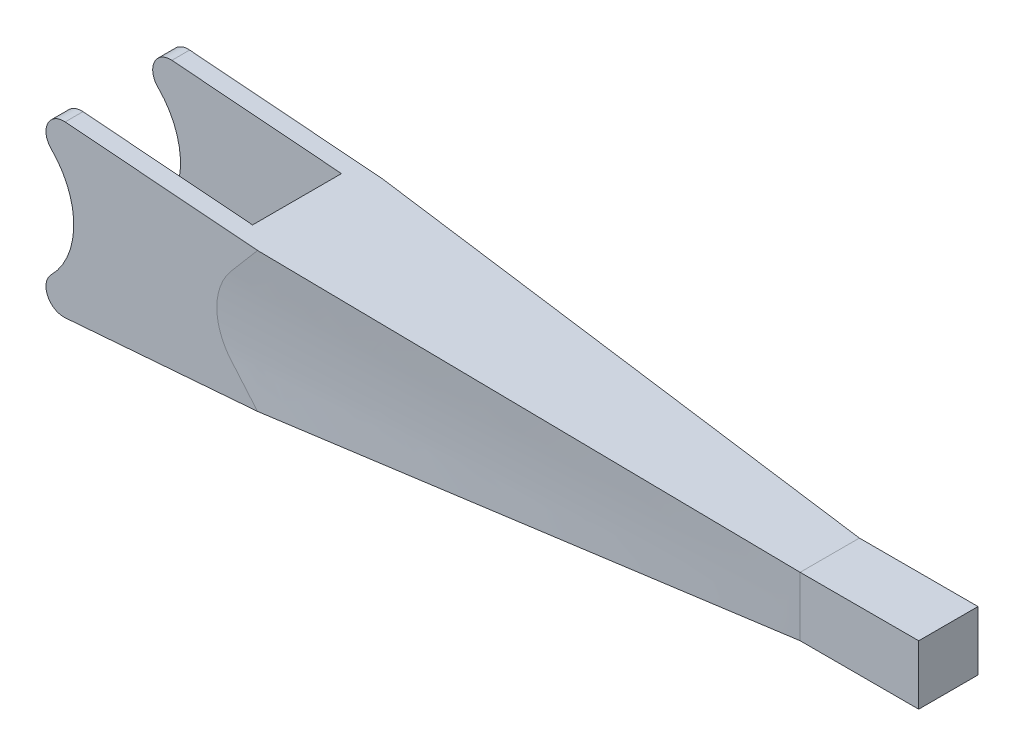
ISO-10303-21;
HEADER;
FILE_DESCRIPTION(('STEP AP214'),'2;1');
FILE_NAME('part.step','',(''),(''),'','','');
FILE_SCHEMA(('AUTOMOTIVE_DESIGN { 1 0 10303 214 1 1 1 1 }'));
ENDSEC;
DATA;
#1=APPLICATION_CONTEXT('core data for automotive mechanical design processes');
#2=APPLICATION_PROTOCOL_DEFINITION('international standard','automotive_design',2000,#1);
#3=PRODUCT_CONTEXT('',#1,'mechanical');
#4=PRODUCT('Part','Part','',(#3));
#5=PRODUCT_RELATED_PRODUCT_CATEGORY('part','',(#4));
#6=PRODUCT_DEFINITION_FORMATION('','',#4);
#7=PRODUCT_DEFINITION_CONTEXT('part definition',#1,'design');
#8=PRODUCT_DEFINITION('design','',#6,#7);
#9=PRODUCT_DEFINITION_SHAPE('','',#8);
#10=(LENGTH_UNIT() NAMED_UNIT(*) SI_UNIT(.MILLI.,.METRE.));
#11=(NAMED_UNIT(*) PLANE_ANGLE_UNIT() SI_UNIT($,.RADIAN.));
#12=(NAMED_UNIT(*) SI_UNIT($,.STERADIAN.) SOLID_ANGLE_UNIT());
#13=UNCERTAINTY_MEASURE_WITH_UNIT(LENGTH_MEASURE(1.E-05),#10,'distance_accuracy_value','');
#14=(GEOMETRIC_REPRESENTATION_CONTEXT(3) GLOBAL_UNCERTAINTY_ASSIGNED_CONTEXT((#13)) GLOBAL_UNIT_ASSIGNED_CONTEXT((#10,
#11,#12)) REPRESENTATION_CONTEXT('',''));
#15=CARTESIAN_POINT('',(0.,0.,0.));
#16=DIRECTION('',(0.,0.,1.));
#17=DIRECTION('',(1.,0.,0.));
#18=AXIS2_PLACEMENT_3D('',#15,#16,#17);
#19=CARTESIAN_POINT('',(-14.0209082921717,-0.367741944041289,21.));
#20=DIRECTION('',(0.,0.,-1.));
#21=DIRECTION('',(-1.,0.,0.));
#22=AXIS2_PLACEMENT_3D('',#19,#20,#21);
#23=CYLINDRICAL_SURFACE('',#22,13.);
#24=DIRECTION('',(0.,0.,-1.));
#25=VECTOR('',#24,1.);
#26=CARTESIAN_POINT('',(-4.82852013674674,-9.56013009946652,21.));
#27=LINE('',#26,#25);
#28=CARTESIAN_POINT('',(-4.82852013674674,-9.56013009946652,3.));
#29=VERTEX_POINT('',#28);
#30=CARTESIAN_POINT('',(-4.82852013674674,-9.56013009946652,0.));
#31=VERTEX_POINT('',#30);
#32=EDGE_CURVE('E106',#29,#31,#27,.T.);
#33=ORIENTED_EDGE('',*,*,#32,.F.);
#34=CARTESIAN_POINT('',(-14.0209082921717,-0.367741944041289,3.));
#35=DIRECTION('',(0.,0.,1.));
#36=DIRECTION('',(1.,0.,0.));
#37=AXIS2_PLACEMENT_3D('',#34,#35,#36);
#38=CIRCLE('',#37,13.);
#39=CARTESIAN_POINT('',(-4.82852013674655,8.82464621138375,3.));
#40=VERTEX_POINT('',#39);
#41=EDGE_CURVE('E234',#29,#40,#38,.T.);
#42=ORIENTED_EDGE('',*,*,#41,.T.);
#43=DIRECTION('',(0.,0.,-1.));
#44=VECTOR('',#43,1.);
#45=CARTESIAN_POINT('',(-4.82852013674655,8.82464621138375,21.));
#46=LINE('',#45,#44);
#47=CARTESIAN_POINT('',(-4.82852013674655,8.82464621138375,0.));
#48=VERTEX_POINT('',#47);
#49=EDGE_CURVE('E230',#40,#48,#46,.T.);
#50=ORIENTED_EDGE('',*,*,#49,.T.);
#51=CARTESIAN_POINT('',(-14.0209082921717,-0.367741944041289,0.));
#52=DIRECTION('',(0.,0.,1.));
#53=DIRECTION('',(1.,0.,0.));
#54=AXIS2_PLACEMENT_3D('',#51,#52,#53);
#55=CIRCLE('',#54,13.);
#56=EDGE_CURVE('E233',#31,#48,#55,.T.);
#57=ORIENTED_EDGE('',*,*,#56,.F.);
#58=EDGE_LOOP('',(#33,#42,#50,#57));
#59=FACE_BOUND('',#58,.T.);
#60=ADVANCED_FACE('F95',(#59),#23,.F.);
#61=CARTESIAN_POINT('',(-2.70719979318713,-11.6814504430262,21.));
#62=DIRECTION('',(0.,0.,-1.));
#63=DIRECTION('',(-1.,0.,0.));
#64=AXIS2_PLACEMENT_3D('',#61,#62,#63);
#65=CYLINDRICAL_SURFACE('',#64,3.);
#66=CARTESIAN_POINT('',(-2.70719979318713,-11.6814504430262,3.));
#67=DIRECTION('',(0.,0.,1.));
#68=DIRECTION('',(1.,0.,0.));
#69=AXIS2_PLACEMENT_3D('',#66,#67,#68);
#70=CIRCLE('',#69,3.);
#71=CARTESIAN_POINT('',(-2.47226989462547,-14.6722376208043,3.));
#72=VERTEX_POINT('',#71);
#73=EDGE_CURVE('E590',#72,#29,#70,.F.);
#74=ORIENTED_EDGE('',*,*,#73,.T.);
#75=ORIENTED_EDGE('',*,*,#32,.T.);
#76=CARTESIAN_POINT('',(-2.70719979318713,-11.6814504430262,0.));
#77=DIRECTION('',(0.,0.,1.));
#78=DIRECTION('',(1.,0.,0.));
#79=AXIS2_PLACEMENT_3D('',#76,#77,#78);
#80=CIRCLE('',#79,3.);
#81=CARTESIAN_POINT('',(-2.47226989462547,-14.6722376208043,0.));
#82=VERTEX_POINT('',#81);
#83=EDGE_CURVE('E252',#31,#82,#80,.T.);
#84=ORIENTED_EDGE('',*,*,#83,.T.);
#85=DIRECTION('',(0.,0.,-1.));
#86=VECTOR('',#85,1.);
#87=CARTESIAN_POINT('',(-2.47226989462547,-14.6722376208043,21.));
#88=LINE('',#87,#86);
#89=EDGE_CURVE('E271',#72,#82,#88,.T.);
#90=ORIENTED_EDGE('',*,*,#89,.F.);
#91=EDGE_LOOP('',(#74,#75,#84,#90));
#92=FACE_BOUND('',#91,.T.);
#93=ADVANCED_FACE('F603',(#92),#65,.T.);
#94=CARTESIAN_POINT('',(-2.70719979318689,10.9459665549434,21.));
#95=DIRECTION('',(0.,0.,-1.));
#96=DIRECTION('',(-1.,0.,0.));
#97=AXIS2_PLACEMENT_3D('',#94,#95,#96);
#98=CYLINDRICAL_SURFACE('',#97,3.);
#99=CARTESIAN_POINT('',(-2.70719979318689,10.9459665549434,3.));
#100=DIRECTION('',(0.,0.,1.));
#101=DIRECTION('',(1.,0.,0.));
#102=AXIS2_PLACEMENT_3D('',#99,#100,#101);
#103=CIRCLE('',#102,3.);
#104=CARTESIAN_POINT('',(-2.47226989462524,13.9367537327214,3.00000000000001));
#105=VERTEX_POINT('',#104);
#106=EDGE_CURVE('E596',#40,#105,#103,.F.);
#107=ORIENTED_EDGE('',*,*,#106,.T.);
#108=DIRECTION('',(0.,0.,-1.));
#109=VECTOR('',#108,1.);
#110=CARTESIAN_POINT('',(-2.47226989462524,13.9367537327214,21.));
#111=LINE('',#110,#109);
#112=CARTESIAN_POINT('',(-2.47226989462524,13.9367537327214,0.));
#113=VERTEX_POINT('',#112);
#114=EDGE_CURVE('E223',#105,#113,#111,.T.);
#115=ORIENTED_EDGE('',*,*,#114,.T.);
#116=CARTESIAN_POINT('',(-2.70719979318689,10.9459665549434,0.));
#117=DIRECTION('',(0.,0.,1.));
#118=DIRECTION('',(1.,0.,0.));
#119=AXIS2_PLACEMENT_3D('',#116,#117,#118);
#120=CIRCLE('',#119,3.);
#121=EDGE_CURVE('E240',#113,#48,#120,.T.);
#122=ORIENTED_EDGE('',*,*,#121,.T.);
#123=ORIENTED_EDGE('',*,*,#49,.F.);
#124=EDGE_LOOP('',(#107,#115,#122,#123));
#125=FACE_BOUND('',#124,.T.);
#126=ADVANCED_FACE('F241',(#125),#98,.T.);
#127=CARTESIAN_POINT('',(-14.0209082921717,-0.367741944041289,18.));
#128=DIRECTION('',(0.,0.,1.));
#129=DIRECTION('',(1.,0.,0.));
#130=AXIS2_PLACEMENT_3D('',#127,#128,#129);
#131=CIRCLE('',#130,13.);
#132=CARTESIAN_POINT('',(-4.82852013674655,8.82464621138375,18.));
#133=VERTEX_POINT('',#132);
#134=CARTESIAN_POINT('',(-4.82852013674674,-9.56013009946652,18.));
#135=VERTEX_POINT('',#134);
#136=EDGE_CURVE('E561',#133,#135,#131,.F.);
#137=ORIENTED_EDGE('',*,*,#136,.T.);
#138=CARTESIAN_POINT('',(-4.82852013674674,-9.56013009946652,21.));
#139=VERTEX_POINT('',#138);
#140=EDGE_CURVE('E13',#139,#135,#27,.T.);
#141=ORIENTED_EDGE('',*,*,#140,.F.);
#142=CARTESIAN_POINT('',(-14.0209082921717,-0.367741944041289,21.));
#143=DIRECTION('',(0.,0.,1.));
#144=DIRECTION('',(1.,0.,0.));
#145=AXIS2_PLACEMENT_3D('',#142,#143,#144);
#146=CIRCLE('',#145,13.);
#147=CARTESIAN_POINT('',(-4.82852013674655,8.82464621138375,21.));
#148=VERTEX_POINT('',#147);
#149=EDGE_CURVE('E245',#139,#148,#146,.T.);
#150=ORIENTED_EDGE('',*,*,#149,.T.);
#151=EDGE_CURVE('E236',#148,#133,#46,.T.);
#152=ORIENTED_EDGE('',*,*,#151,.T.);
#153=EDGE_LOOP('',(#137,#141,#150,#152));
#154=FACE_BOUND('',#153,.T.);
#155=ADVANCED_FACE('F97',(#154),#23,.F.);
#156=ORIENTED_EDGE('',*,*,#140,.T.);
#157=CARTESIAN_POINT('',(-2.70719979318713,-11.6814504430262,18.));
#158=DIRECTION('',(0.,0.,1.));
#159=DIRECTION('',(1.,0.,0.));
#160=AXIS2_PLACEMENT_3D('',#157,#158,#159);
#161=CIRCLE('',#160,3.);
#162=CARTESIAN_POINT('',(-2.47226989462547,-14.6722376208043,18.));
#163=VERTEX_POINT('',#162);
#164=EDGE_CURVE('E557',#135,#163,#161,.T.);
#165=ORIENTED_EDGE('',*,*,#164,.T.);
#166=CARTESIAN_POINT('',(-2.47226989462547,-14.6722376208043,21.));
#167=VERTEX_POINT('',#166);
#168=EDGE_CURVE('E272',#167,#163,#88,.T.);
#169=ORIENTED_EDGE('',*,*,#168,.F.);
#170=CARTESIAN_POINT('',(-2.70719979318713,-11.6814504430262,21.));
#171=DIRECTION('',(0.,0.,1.));
#172=DIRECTION('',(1.,0.,0.));
#173=AXIS2_PLACEMENT_3D('',#170,#171,#172);
#174=CIRCLE('',#173,3.);
#175=EDGE_CURVE('E489',#139,#167,#174,.T.);
#176=ORIENTED_EDGE('',*,*,#175,.F.);
#177=EDGE_LOOP('',(#156,#165,#169,#176));
#178=FACE_BOUND('',#177,.T.);
#179=ADVANCED_FACE('F633',(#178),#65,.T.);
#180=CARTESIAN_POINT('',(1.13029290151178,-14.3892520180349,21.));
#181=DIRECTION('',(0.0783099661872184,-0.996929059259362,0.));
#182=DIRECTION('',(0.996929059259362,0.0783099661872184,0.));
#183=AXIS2_PLACEMENT_3D('',#180,#181,#182);
#184=PLANE('',#183);
#185=DIRECTION('',(0.996929059259362,0.0783099661872184,0.));
#186=VECTOR('',#185,1.);
#187=CARTESIAN_POINT('',(1.13029290151178,-14.3892520180349,18.));
#188=LINE('',#187,#186);
#189=CARTESIAN_POINT('',(26.128702031817,-12.4255971766535,18.));
#190=VERTEX_POINT('',#189);
#191=EDGE_CURVE('E553',#163,#190,#188,.T.);
#192=ORIENTED_EDGE('',*,*,#191,.T.);
#193=DIRECTION('',(0.,0.,1.));
#194=VECTOR('',#193,1.);
#195=CARTESIAN_POINT('',(26.128702031817,-12.4255971766535,-42.8141757947871));
#196=LINE('',#195,#194);
#197=CARTESIAN_POINT('',(26.128702031817,-12.4255971766535,3.));
#198=VERTEX_POINT('',#197);
#199=EDGE_CURVE('E544',#198,#190,#196,.T.);
#200=ORIENTED_EDGE('',*,*,#199,.F.);
#201=DIRECTION('',(-0.996929059259362,-0.0783099661872184,0.));
#202=VECTOR('',#201,1.);
#203=CARTESIAN_POINT('',(1.13029290151178,-14.3892520180349,3.));
#204=LINE('',#203,#202);
#205=EDGE_CURVE('E586',#198,#72,#204,.T.);
#206=ORIENTED_EDGE('',*,*,#205,.T.);
#207=ORIENTED_EDGE('',*,*,#89,.T.);
#208=DIRECTION('',(-0.996929059259362,-0.0783099661872184,0.));
#209=VECTOR('',#208,1.);
#210=CARTESIAN_POINT('',(1.13029290151178,-14.3892520180349,0.));
#211=LINE('',#210,#209);
#212=CARTESIAN_POINT('',(29.9790917078283,-12.123144477,0.));
#213=VERTEX_POINT('',#212);
#214=EDGE_CURVE('E258',#213,#82,#211,.T.);
#215=ORIENTED_EDGE('',*,*,#214,.F.);
#216=DIRECTION('',(0.99490897417076,0.078151286095075,0.0636278995109207));
#217=VECTOR('',#216,1.);
#218=CARTESIAN_POINT('',(29.9790917078283,-12.123144477,0.));
#219=LINE('',#218,#217);
#220=CARTESIAN_POINT('',(115.979091707828,-5.36774194404139,5.5));
#221=VERTEX_POINT('',#220);
#222=EDGE_CURVE('E324',#221,#213,#219,.F.);
#223=ORIENTED_EDGE('',*,*,#222,.F.);
#224=DIRECTION('',(0.,0.,1.));
#225=VECTOR('',#224,1.);
#226=CARTESIAN_POINT('',(115.979091707828,-5.36774194404139,0.));
#227=LINE('',#226,#225);
#228=CARTESIAN_POINT('',(115.979091707828,-5.36774194404134,15.5));
#229=VERTEX_POINT('',#228);
#230=EDGE_CURVE('E464',#229,#221,#227,.F.);
#231=ORIENTED_EDGE('',*,*,#230,.F.);
#232=DIRECTION('',(-0.99490897417076,-0.078151286095075,0.0636278995109207));
#233=VECTOR('',#232,1.);
#234=CARTESIAN_POINT('',(115.979091707828,-5.3677419440413,15.5));
#235=LINE('',#234,#233);
#236=CARTESIAN_POINT('',(29.9790917078283,-12.123144477,21.));
#237=VERTEX_POINT('',#236);
#238=EDGE_CURVE('E319',#229,#237,#235,.T.);
#239=ORIENTED_EDGE('',*,*,#238,.T.);
#240=DIRECTION('',(-0.996929059259362,-0.0783099661872184,0.));
#241=VECTOR('',#240,1.);
#242=CARTESIAN_POINT('',(1.13029290151178,-14.3892520180349,21.));
#243=LINE('',#242,#241);
#244=EDGE_CURVE('E485',#237,#167,#243,.T.);
#245=ORIENTED_EDGE('',*,*,#244,.T.);
#246=ORIENTED_EDGE('',*,*,#168,.T.);
#247=EDGE_LOOP('',(#192,#200,#206,#207,#215,#223,#231,#239,#245,#246));
#248=FACE_BOUND('',#247,.T.);
#249=ADVANCED_FACE('F608',(#248),#184,.T.);
#250=CARTESIAN_POINT('',(1.07287405614289,13.658278448713,21.));
#251=DIRECTION('',(-0.0783099661872163,-0.996929059259362,0.));
#252=DIRECTION('',(0.996929059259362,-0.0783099661872163,0.));
#253=AXIS2_PLACEMENT_3D('',#250,#251,#252);
#254=PLANE('',#253);
#255=DIRECTION('',(0.,0.,1.));
#256=VECTOR('',#255,1.);
#257=CARTESIAN_POINT('',(26.1287020318169,11.6901132885707,-42.8141757947871));
#258=LINE('',#257,#256);
#259=CARTESIAN_POINT('',(26.1287020318169,11.6901132885707,2.99999999999999));
#260=VERTEX_POINT('',#259);
#261=CARTESIAN_POINT('',(26.1287020318169,11.6901132885707,18.));
#262=VERTEX_POINT('',#261);
#263=EDGE_CURVE('E540',#260,#262,#258,.T.);
#264=ORIENTED_EDGE('',*,*,#263,.T.);
#265=DIRECTION('',(-0.996929059259362,0.0783099661872163,0.));
#266=VECTOR('',#265,1.);
#267=CARTESIAN_POINT('',(1.07287405614289,13.658278448713,18.));
#268=LINE('',#267,#266);
#269=CARTESIAN_POINT('',(-2.47226989462524,13.9367537327215,18.));
#270=VERTEX_POINT('',#269);
#271=EDGE_CURVE('E569',#262,#270,#268,.T.);
#272=ORIENTED_EDGE('',*,*,#271,.T.);
#273=CARTESIAN_POINT('',(-2.47226989462524,13.9367537327214,21.));
#274=VERTEX_POINT('',#273);
#275=EDGE_CURVE('E267',#274,#270,#111,.T.);
#276=ORIENTED_EDGE('',*,*,#275,.F.);
#277=DIRECTION('',(-0.996929059259362,0.0783099661872163,0.));
#278=VECTOR('',#277,1.);
#279=CARTESIAN_POINT('',(1.07287405614289,13.658278448713,21.));
#280=LINE('',#279,#278);
#281=CARTESIAN_POINT('',(29.9790917078282,11.3876605889172,21.));
#282=VERTEX_POINT('',#281);
#283=EDGE_CURVE('E521',#282,#274,#280,.T.);
#284=ORIENTED_EDGE('',*,*,#283,.F.);
#285=DIRECTION('',(0.99490897417076,-0.0781512860950729,-0.0636278995109207));
#286=VECTOR('',#285,1.);
#287=CARTESIAN_POINT('',(29.9790917078283,11.3876605889172,21.));
#288=LINE('',#287,#286);
#289=CARTESIAN_POINT('',(115.979091707828,4.63225805595866,15.5));
#290=VERTEX_POINT('',#289);
#291=EDGE_CURVE('E310',#290,#282,#288,.F.);
#292=ORIENTED_EDGE('',*,*,#291,.F.);
#293=DIRECTION('',(0.,0.,1.));
#294=VECTOR('',#293,1.);
#295=CARTESIAN_POINT('',(115.979091707828,4.63225805595861,0.));
#296=LINE('',#295,#294);
#297=CARTESIAN_POINT('',(115.979091707828,4.63225805595866,5.5));
#298=VERTEX_POINT('',#297);
#299=EDGE_CURVE('E447',#298,#290,#296,.T.);
#300=ORIENTED_EDGE('',*,*,#299,.F.);
#301=DIRECTION('',(-0.99490897417076,0.0781512860950729,-0.0636278995109207));
#302=VECTOR('',#301,1.);
#303=CARTESIAN_POINT('',(115.979091707828,4.6322580559587,5.5));
#304=LINE('',#303,#302);
#305=CARTESIAN_POINT('',(29.9790917078282,11.3876605889172,0.));
#306=VERTEX_POINT('',#305);
#307=EDGE_CURVE('E330',#306,#298,#304,.F.);
#308=ORIENTED_EDGE('',*,*,#307,.F.);
#309=DIRECTION('',(-0.996929059259362,0.0783099661872163,0.));
#310=VECTOR('',#309,1.);
#311=CARTESIAN_POINT('',(1.07287405614289,13.658278448713,0.));
#312=LINE('',#311,#310);
#313=EDGE_CURVE('E246',#306,#113,#312,.T.);
#314=ORIENTED_EDGE('',*,*,#313,.T.);
#315=ORIENTED_EDGE('',*,*,#114,.F.);
#316=DIRECTION('',(0.996929059259362,-0.0783099661872163,0.));
#317=VECTOR('',#316,1.);
#318=CARTESIAN_POINT('',(1.07287405614289,13.658278448713,3.));
#319=LINE('',#318,#317);
#320=EDGE_CURVE('E115',#105,#260,#319,.T.);
#321=ORIENTED_EDGE('',*,*,#320,.T.);
#322=EDGE_LOOP('',(#264,#272,#276,#284,#292,#300,#308,#314,#315,#321));
#323=FACE_BOUND('',#322,.T.);
#324=ADVANCED_FACE('F475',(#323),#254,.F.);
#325=ORIENTED_EDGE('',*,*,#275,.T.);
#326=CARTESIAN_POINT('',(-2.70719979318689,10.9459665549434,18.));
#327=DIRECTION('',(0.,0.,1.));
#328=DIRECTION('',(1.,0.,0.));
#329=AXIS2_PLACEMENT_3D('',#326,#327,#328);
#330=CIRCLE('',#329,3.);
#331=EDGE_CURVE('E565',#270,#133,#330,.T.);
#332=ORIENTED_EDGE('',*,*,#331,.T.);
#333=ORIENTED_EDGE('',*,*,#151,.F.);
#334=CARTESIAN_POINT('',(-2.70719979318689,10.9459665549434,21.));
#335=DIRECTION('',(0.,0.,1.));
#336=DIRECTION('',(1.,0.,0.));
#337=AXIS2_PLACEMENT_3D('',#334,#335,#336);
#338=CIRCLE('',#337,3.);
#339=EDGE_CURVE('E237',#274,#148,#338,.T.);
#340=ORIENTED_EDGE('',*,*,#339,.F.);
#341=EDGE_LOOP('',(#325,#332,#333,#340));
#342=FACE_BOUND('',#341,.T.);
#343=ADVANCED_FACE('F298',(#342),#98,.T.);
#344=CARTESIAN_POINT('',(0.,0.,21.));
#345=DIRECTION('',(0.,0.,1.));
#346=DIRECTION('',(1.,0.,0.));
#347=AXIS2_PLACEMENT_3D('',#344,#345,#346);
#348=PLANE('',#347);
#349=ORIENTED_EDGE('',*,*,#149,.F.);
#350=ORIENTED_EDGE('',*,*,#175,.T.);
#351=ORIENTED_EDGE('',*,*,#244,.F.);
#352=CARTESIAN_POINT('',(29.9790917078282,11.3876605889172,21.));
#353=CARTESIAN_POINT('',(29.6050832361166,10.9479985753465,21.));
#354=CARTESIAN_POINT('',(28.8618686039391,10.0743198583834,21.));
#355=CARTESIAN_POINT('',(27.7506022703514,8.76798155111849,21.));
#356=CARTESIAN_POINT('',(26.6324100981968,7.45350164183053,21.));
#357=CARTESIAN_POINT('',(25.8749225329453,6.56304451750625,21.));
#358=CARTESIAN_POINT('',(24.7397024696747,5.22854763678262,21.));
#359=CARTESIAN_POINT('',(23.5329933143023,3.17984394365187,21.));
#360=CARTESIAN_POINT('',(22.8948246290648,-0.367741944041331,21.));
#361=CARTESIAN_POINT('',(23.5329933143023,-3.91532783173453,21.));
#362=CARTESIAN_POINT('',(24.7397024696747,-5.9640315248653,21.));
#363=CARTESIAN_POINT('',(25.8749225329453,-7.29852840558893,21.));
#364=CARTESIAN_POINT('',(26.6324100981968,-8.18898552991323,21.));
#365=CARTESIAN_POINT('',(27.7506022703514,-9.50346543920123,21.));
#366=CARTESIAN_POINT('',(28.8618686039391,-10.8098037464661,21.));
#367=CARTESIAN_POINT('',(29.6050832361166,-11.6834824634292,21.));
#368=CARTESIAN_POINT('',(29.9790917078283,-12.123144477,21.));
#369=B_SPLINE_CURVE_WITH_KNOTS('',3,(#352,#353,#354,#355,#356,#357,#358,#359,#360,#361,#362,
#363,#364,#365,#366,#367,#368),.UNSPECIFIED.,.F.,.F.,(4,1,1,1,2,1,1,1,2,1,1,1,4),(0.,
0.0631820162488794,0.126364032497759,0.189546048746638,0.252728064995518,0.376364032497758,
0.499999999999998,0.623635967502238,0.747271935004479,0.810453951253359,0.873635967502239,
0.93681798375112,1.),.UNSPECIFIED.);
#370=CARTESIAN_POINT('',(25.4909900383754,-6.84720030367374,21.));
#371=VERTEX_POINT('',#370);
#372=EDGE_CURVE('E143',#371,#237,#369,.T.);
#373=ORIENTED_EDGE('',*,*,#372,.F.);
#374=CARTESIAN_POINT('',(29.9790917078282,11.3876605889172,21.));
#375=CARTESIAN_POINT('',(29.6050832361166,10.9479985753465,21.));
#376=CARTESIAN_POINT('',(28.8618686039391,10.0743198583834,21.));
#377=CARTESIAN_POINT('',(27.7506022703514,8.76798155111849,21.));
#378=CARTESIAN_POINT('',(26.6324100981968,7.45350164183053,21.));
#379=CARTESIAN_POINT('',(25.8749225329453,6.56304451750625,21.));
#380=CARTESIAN_POINT('',(24.7397024696747,5.22854763678262,21.));
#381=CARTESIAN_POINT('',(23.5329933143023,3.17984394365187,21.));
#382=CARTESIAN_POINT('',(22.8948246290648,-0.367741944041331,21.));
#383=CARTESIAN_POINT('',(23.5329933143023,-3.91532783173453,21.));
#384=CARTESIAN_POINT('',(24.7397024696747,-5.9640315248653,21.));
#385=CARTESIAN_POINT('',(25.8749225329453,-7.29852840558893,21.));
#386=CARTESIAN_POINT('',(26.6324100981968,-8.18898552991323,21.));
#387=CARTESIAN_POINT('',(27.7506022703514,-9.50346543920123,21.));
#388=CARTESIAN_POINT('',(28.8618686039391,-10.8098037464661,21.));
#389=CARTESIAN_POINT('',(29.6050832361166,-11.6834824634292,21.));
#390=CARTESIAN_POINT('',(29.9790917078283,-12.123144477,21.));
#391=B_SPLINE_CURVE_WITH_KNOTS('',3,(#374,#375,#376,#377,#378,#379,#380,#381,#382,#383,#384,
#385,#386,#387,#388,#389,#390),.UNSPECIFIED.,.F.,.F.,(4,1,1,1,2,1,1,1,2,1,1,1,4),(0.,
0.0631820162488794,0.126364032497759,0.189546048746638,0.252728064995518,0.376364032497758,
0.499999999999998,0.623635967502238,0.747271935004479,0.810453951253359,0.873635967502239,
0.93681798375112,1.),.UNSPECIFIED.);
#392=CARTESIAN_POINT('',(25.4909900383754,6.11171641559106,21.));
#393=VERTEX_POINT('',#392);
#394=EDGE_CURVE('E382',#393,#371,#391,.T.);
#395=ORIENTED_EDGE('',*,*,#394,.F.);
#396=CARTESIAN_POINT('',(29.9790917078282,11.3876605889172,21.));
#397=CARTESIAN_POINT('',(29.6050832361166,10.9479985753465,21.));
#398=CARTESIAN_POINT('',(28.8618686039391,10.0743198583834,21.));
#399=CARTESIAN_POINT('',(27.7506022703514,8.76798155111849,21.));
#400=CARTESIAN_POINT('',(26.6324100981968,7.45350164183053,21.));
#401=CARTESIAN_POINT('',(25.8749225329453,6.56304451750625,21.));
#402=CARTESIAN_POINT('',(24.7397024696747,5.22854763678262,21.));
#403=CARTESIAN_POINT('',(23.5329933143023,3.17984394365187,21.));
#404=CARTESIAN_POINT('',(22.8948246290648,-0.367741944041331,21.));
#405=CARTESIAN_POINT('',(23.5329933143023,-3.91532783173453,21.));
#406=CARTESIAN_POINT('',(24.7397024696747,-5.9640315248653,21.));
#407=CARTESIAN_POINT('',(25.8749225329453,-7.29852840558893,21.));
#408=CARTESIAN_POINT('',(26.6324100981968,-8.18898552991323,21.));
#409=CARTESIAN_POINT('',(27.7506022703514,-9.50346543920123,21.));
#410=CARTESIAN_POINT('',(28.8618686039391,-10.8098037464661,21.));
#411=CARTESIAN_POINT('',(29.6050832361166,-11.6834824634292,21.));
#412=CARTESIAN_POINT('',(29.9790917078283,-12.123144477,21.));
#413=B_SPLINE_CURVE_WITH_KNOTS('',3,(#396,#397,#398,#399,#400,#401,#402,#403,#404,#405,#406,
#407,#408,#409,#410,#411,#412),.UNSPECIFIED.,.F.,.F.,(4,1,1,1,2,1,1,1,2,1,1,1,4),(0.,
0.0631820162488794,0.126364032497759,0.189546048746638,0.252728064995518,0.376364032497758,
0.499999999999998,0.623635967502238,0.747271935004479,0.810453951253359,0.873635967502239,
0.93681798375112,1.),.UNSPECIFIED.);
#414=EDGE_CURVE('E396',#282,#393,#413,.T.);
#415=ORIENTED_EDGE('',*,*,#414,.F.);
#416=ORIENTED_EDGE('',*,*,#283,.T.);
#417=ORIENTED_EDGE('',*,*,#339,.T.);
#418=EDGE_LOOP('',(#349,#350,#351,#373,#395,#415,#416,#417));
#419=FACE_BOUND('',#418,.T.);
#420=ADVANCED_FACE('F295',(#419),#348,.T.);
#421=CARTESIAN_POINT('',(0.,0.,0.));
#422=DIRECTION('',(0.,0.,1.));
#423=DIRECTION('',(1.,0.,0.));
#424=AXIS2_PLACEMENT_3D('',#421,#422,#423);
#425=PLANE('',#424);
#426=ORIENTED_EDGE('',*,*,#56,.T.);
#427=ORIENTED_EDGE('',*,*,#121,.F.);
#428=ORIENTED_EDGE('',*,*,#313,.F.);
#429=CARTESIAN_POINT('',(29.9790917078283,-12.123144477,0.));
#430=CARTESIAN_POINT('',(29.6050832361166,-11.6834824634292,0.));
#431=CARTESIAN_POINT('',(28.861868603939,-10.8098037464661,0.));
#432=CARTESIAN_POINT('',(27.7506022703515,-9.50346543920124,0.));
#433=CARTESIAN_POINT('',(26.6324100981968,-8.18898552991322,0.));
#434=CARTESIAN_POINT('',(25.8749225329453,-7.29852840558894,0.));
#435=CARTESIAN_POINT('',(24.7397024696747,-5.9640315248653,0.));
#436=CARTESIAN_POINT('',(23.5329933143023,-3.91532783173453,0.));
#437=CARTESIAN_POINT('',(22.8948246290649,-0.367741944041329,0.));
#438=CARTESIAN_POINT('',(23.5329933143023,3.17984394365187,0.));
#439=CARTESIAN_POINT('',(24.7397024696747,5.22854763678263,0.));
#440=CARTESIAN_POINT('',(25.8749225329453,6.56304451750625,0.));
#441=CARTESIAN_POINT('',(26.6324100981969,7.45350164183053,0.));
#442=CARTESIAN_POINT('',(27.7506022703513,8.7679815511185,0.));
#443=CARTESIAN_POINT('',(28.8618686039392,10.0743198583834,0.));
#444=CARTESIAN_POINT('',(29.6050832361166,10.9479985753465,0.));
#445=CARTESIAN_POINT('',(29.9790917078282,11.3876605889172,0.));
#446=B_SPLINE_CURVE_WITH_KNOTS('',3,(#429,#430,#431,#432,#433,#434,#435,#436,#437,#438,#439,
#440,#441,#442,#443,#444,#445),.UNSPECIFIED.,.F.,.F.,(4,1,1,1,2,1,1,1,2,1,1,1,4),(0.,
0.0631820162488804,0.126364032497761,0.189546048746641,0.252728064995522,0.376364032497762,
0.500000000000002,0.623635967502242,0.747271935004483,0.810453951253362,0.873635967502241,
0.936817983751121,1.),.UNSPECIFIED.);
#447=CARTESIAN_POINT('',(25.4909900472884,6.11171642606868,0.));
#448=VERTEX_POINT('',#447);
#449=EDGE_CURVE('E279',#306,#448,#446,.F.);
#450=ORIENTED_EDGE('',*,*,#449,.T.);
#451=CARTESIAN_POINT('',(25.4909900472884,6.11171642606868,0.));
#452=CARTESIAN_POINT('',(25.3088593170299,5.89759131679058,0.));
#453=CARTESIAN_POINT('',(25.1358598660907,5.67572644944367,0.));
#454=CARTESIAN_POINT('',(24.8090881105719,5.21821436047642,0.));
#455=CARTESIAN_POINT('',(24.6553183764136,4.9825653024999,0.));
#456=CARTESIAN_POINT('',(24.368126487868,4.49941956811638,0.));
#457=CARTESIAN_POINT('',(24.2346893073426,4.25193182019924,0.));
#458=CARTESIAN_POINT('',(23.9890624419294,3.74664641366994,0.));
#459=CARTESIAN_POINT('',(23.8768706426814,3.48884978410338,0.));
#460=CARTESIAN_POINT('',(23.674824786902,2.96448079811008,0.));
#461=CARTESIAN_POINT('',(23.584983182988,2.69790364277263,0.));
#462=CARTESIAN_POINT('',(23.4280800233307,2.15810749057153,0.));
#463=CARTESIAN_POINT('',(23.3610207025303,1.88488784489498,0.));
#464=CARTESIAN_POINT('',(23.2499805056258,1.33389234008433,0.));
#465=CARTESIAN_POINT('',(23.2059929857426,1.05611781636407,0.));
#466=CARTESIAN_POINT('',(23.1414386257863,0.497843737062859,0.));
#467=CARTESIAN_POINT('',(23.1208695660242,0.217344442288029,0.));
#468=CARTESIAN_POINT('',(23.107910506179,-0.203995665275022,0.));
#469=CARTESIAN_POINT('',(23.1065770151311,-0.344610578651511,0.));
#470=CARTESIAN_POINT('',(23.1099157485756,-0.625769039689694,0.));
#471=CARTESIAN_POINT('',(23.1145879945384,-0.766312587094459,0.));
#472=CARTESIAN_POINT('',(23.1375161534791,-1.18747051164911,0.));
#473=CARTESIAN_POINT('',(23.1646823346749,-1.46765049834045,0.));
#474=CARTESIAN_POINT('',(23.2423805436708,-2.02486525991991,0.));
#475=CARTESIAN_POINT('',(23.2929260711621,-2.30189812278022,0.));
#476=CARTESIAN_POINT('',(23.4170493338391,-2.85077825374423,0.));
#477=CARTESIAN_POINT('',(23.4906246907913,-3.12262605422254,0.));
#478=CARTESIAN_POINT('',(23.6180399791447,-3.52501404565895,0.));
#479=CARTESIAN_POINT('',(23.6633759830864,-3.65829989901046,0.));
#480=CARTESIAN_POINT('',(23.7597109780443,-3.92280927030283,0.));
#481=CARTESIAN_POINT('',(23.8107099718152,-4.05403278724049,0.));
#482=CARTESIAN_POINT('',(23.9720253225436,-4.44430959782233,0.));
#483=CARTESIAN_POINT('',(24.0906631471278,-4.69997892333578,0.));
#484=CARTESIAN_POINT('',(24.3487124831032,-5.19993210938924,0.));
#485=CARTESIAN_POINT('',(24.4880842767186,-5.44423659075466,0.));
#486=CARTESIAN_POINT('',(24.7867084582313,-5.92024417056003,0.));
#487=CARTESIAN_POINT('',(24.9459487808962,-6.15195479510388,0.));
#488=CARTESIAN_POINT('',(25.1749792416094,-6.45686467825474,0.));
#489=CARTESIAN_POINT('',(25.2365624737864,-6.53632449384688,0.));
#490=CARTESIAN_POINT('',(25.3620381018534,-6.69324881661445,0.));
#491=CARTESIAN_POINT('',(25.4259277453569,-6.77071552469663,0.));
#492=CARTESIAN_POINT('',(25.4909900383754,-6.84720030367373,0.));
#493=B_SPLINE_CURVE_WITH_KNOTS('',3,(#451,#452,#453,#454,#455,#456,#457,#458,#459,#460,#461,
#462,#463,#464,#465,#466,#467,#468,#469,#470,#471,#472,#473,#474,#475,#476,#477,#478,#479,#480,
#481,#482,#483,#484,#485,#486,#487,#488,#489,#490,#491,#492),.UNSPECIFIED.,.F.,.F.,(4,2,2,2,2,2,
2,2,2,2,2,2,2,2,2,2,2,2,2,2,4),(0.,0.843038884993087,1.68619033816222,2.5287156325953,
3.37115703400673,4.21406676344828,5.05705915850136,5.8998086711578,6.74247829822252,
7.1642304479338,7.5859841053984,8.42937675966548,9.27325701443484,10.1170501525112,
10.5392948262388,10.9615397053585,11.8059988099399,12.6488606245802,13.4912130770771,
13.7927694249885,14.0939770879953),.UNSPECIFIED.);
#494=CARTESIAN_POINT('',(25.4909900383754,-6.84720030367374,0.));
#495=VERTEX_POINT('',#494);
#496=EDGE_CURVE('E333',#448,#495,#493,.T.);
#497=ORIENTED_EDGE('',*,*,#496,.T.);
#498=CARTESIAN_POINT('',(29.9790917078283,-12.123144477,0.));
#499=CARTESIAN_POINT('',(29.6050832361166,-11.6834824634292,0.));
#500=CARTESIAN_POINT('',(28.861868603939,-10.8098037464661,0.));
#501=CARTESIAN_POINT('',(27.7506022703515,-9.50346543920124,0.));
#502=CARTESIAN_POINT('',(26.6324100981968,-8.18898552991322,0.));
#503=CARTESIAN_POINT('',(25.8749225329453,-7.29852840558894,0.));
#504=CARTESIAN_POINT('',(24.7397024696747,-5.9640315248653,0.));
#505=CARTESIAN_POINT('',(23.5329933143023,-3.91532783173453,0.));
#506=CARTESIAN_POINT('',(22.8948246290649,-0.367741944041329,0.));
#507=CARTESIAN_POINT('',(23.5329933143023,3.17984394365187,0.));
#508=CARTESIAN_POINT('',(24.7397024696747,5.22854763678263,0.));
#509=CARTESIAN_POINT('',(25.8749225329453,6.56304451750625,0.));
#510=CARTESIAN_POINT('',(26.6324100981969,7.45350164183053,0.));
#511=CARTESIAN_POINT('',(27.7506022703513,8.7679815511185,0.));
#512=CARTESIAN_POINT('',(28.8618686039392,10.0743198583834,0.));
#513=CARTESIAN_POINT('',(29.6050832361166,10.9479985753465,0.));
#514=CARTESIAN_POINT('',(29.9790917078282,11.3876605889172,0.));
#515=B_SPLINE_CURVE_WITH_KNOTS('',3,(#498,#499,#500,#501,#502,#503,#504,#505,#506,#507,#508,
#509,#510,#511,#512,#513,#514),.UNSPECIFIED.,.F.,.F.,(4,1,1,1,2,1,1,1,2,1,1,1,4),(0.,
0.0631820162488804,0.126364032497761,0.189546048746641,0.252728064995522,0.376364032497762,
0.500000000000002,0.623635967502242,0.747271935004483,0.810453951253362,0.873635967502241,
0.936817983751121,1.),.UNSPECIFIED.);
#516=EDGE_CURVE('E335',#495,#213,#515,.F.);
#517=ORIENTED_EDGE('',*,*,#516,.T.);
#518=ORIENTED_EDGE('',*,*,#214,.T.);
#519=ORIENTED_EDGE('',*,*,#83,.F.);
#520=EDGE_LOOP('',(#426,#427,#428,#450,#497,#517,#518,#519));
#521=FACE_BOUND('',#520,.T.);
#522=ADVANCED_FACE('F249',(#521),#425,.F.);
#523=CARTESIAN_POINT('',(33.1078541809074,-0.367741944041356,-42.8141757947871));
#524=DIRECTION('',(0.,0.,1.));
#525=DIRECTION('',(1.,0.,0.));
#526=AXIS2_PLACEMENT_3D('',#523,#524,#525);
#527=CYLINDRICAL_SURFACE('',#526,13.12876247);
#528=DIRECTION('',(0.,0.,1.));
#529=VECTOR('',#528,1.);
#530=CARTESIAN_POINT('',(23.1078541832528,-8.87446893158409,-42.8141757947871));
#531=LINE('',#530,#529);
#532=CARTESIAN_POINT('',(23.1078541832528,-8.87446893158409,3.));
#533=VERTEX_POINT('',#532);
#534=CARTESIAN_POINT('',(23.1078541832528,-8.87446893158409,18.));
#535=VERTEX_POINT('',#534);
#536=EDGE_CURVE('E547',#533,#535,#531,.T.);
#537=ORIENTED_EDGE('',*,*,#536,.T.);
#538=CARTESIAN_POINT('',(33.1078541809074,-0.367741944041356,18.));
#539=DIRECTION('',(0.,0.,1.));
#540=DIRECTION('',(1.,0.,0.));
#541=AXIS2_PLACEMENT_3D('',#538,#539,#540);
#542=CIRCLE('',#541,13.12876247);
#543=CARTESIAN_POINT('',(23.1078541832528,8.13898504350142,18.));
#544=VERTEX_POINT('',#543);
#545=EDGE_CURVE('E318',#544,#535,#542,.T.);
#546=ORIENTED_EDGE('',*,*,#545,.F.);
#547=DIRECTION('',(0.,0.,1.));
#548=VECTOR('',#547,1.);
#549=CARTESIAN_POINT('',(23.1078541832528,8.13898504350142,-42.8141757947871));
#550=LINE('',#549,#548);
#551=CARTESIAN_POINT('',(23.1078541832528,8.13898504350143,3.));
#552=VERTEX_POINT('',#551);
#553=EDGE_CURVE('E537',#552,#544,#550,.T.);
#554=ORIENTED_EDGE('',*,*,#553,.F.);
#555=CARTESIAN_POINT('',(33.1078541809074,-0.367741944041356,3.));
#556=DIRECTION('',(0.,0.,1.));
#557=DIRECTION('',(1.,0.,0.));
#558=AXIS2_PLACEMENT_3D('',#555,#556,#557);
#559=CIRCLE('',#558,13.12876247);
#560=EDGE_CURVE('E260',#533,#552,#559,.F.);
#561=ORIENTED_EDGE('',*,*,#560,.F.);
#562=EDGE_LOOP('',(#537,#546,#554,#561));
#563=FACE_BOUND('',#562,.T.);
#564=ADVANCED_FACE('F294',(#563),#527,.T.);
#565=CARTESIAN_POINT('',(9.02656544950729,7.67865279321528,-42.8141757947871));
#566=DIRECTION('',(0.761686413361905,0.647945837010994,0.));
#567=DIRECTION('',(-0.647945837010994,0.761686413361905,0.));
#568=AXIS2_PLACEMENT_3D('',#565,#566,#567);
#569=PLANE('',#568);
#570=DIRECTION('',(0.647945837010994,-0.761686413361905,0.));
#571=VECTOR('',#570,1.);
#572=CARTESIAN_POINT('',(9.02656544950729,7.67865279321528,3.));
#573=LINE('',#572,#571);
#574=EDGE_CURVE('E583',#533,#198,#573,.T.);
#575=ORIENTED_EDGE('',*,*,#574,.T.);
#576=ORIENTED_EDGE('',*,*,#199,.T.);
#577=DIRECTION('',(-0.647945837010994,0.761686413361905,0.));
#578=VECTOR('',#577,1.);
#579=CARTESIAN_POINT('',(9.02656544950729,7.67865279321528,18.));
#580=LINE('',#579,#578);
#581=EDGE_CURVE('E541',#190,#535,#580,.T.);
#582=ORIENTED_EDGE('',*,*,#581,.T.);
#583=ORIENTED_EDGE('',*,*,#536,.F.);
#584=EDGE_LOOP('',(#575,#576,#582,#583));
#585=FACE_BOUND('',#584,.T.);
#586=ADVANCED_FACE('F611',(#585),#569,.F.);
#587=CARTESIAN_POINT('',(9.38954994591268,-7.98743379445093,-42.8141757947871));
#588=DIRECTION('',(0.761686413361901,-0.647945837010999,0.));
#589=DIRECTION('',(0.647945837010999,0.761686413361901,0.));
#590=AXIS2_PLACEMENT_3D('',#587,#588,#589);
#591=PLANE('',#590);
#592=DIRECTION('',(-0.647945837010999,-0.761686413361901,0.));
#593=VECTOR('',#592,1.);
#594=CARTESIAN_POINT('',(9.38954994591268,-7.98743379445093,3.));
#595=LINE('',#594,#593);
#596=EDGE_CURVE('E254',#260,#552,#595,.T.);
#597=ORIENTED_EDGE('',*,*,#596,.T.);
#598=ORIENTED_EDGE('',*,*,#553,.T.);
#599=DIRECTION('',(0.647945837010999,0.761686413361901,0.));
#600=VECTOR('',#599,1.);
#601=CARTESIAN_POINT('',(9.38954994591268,-7.98743379445093,18.));
#602=LINE('',#601,#600);
#603=EDGE_CURVE('E573',#544,#262,#602,.T.);
#604=ORIENTED_EDGE('',*,*,#603,.T.);
#605=ORIENTED_EDGE('',*,*,#263,.F.);
#606=EDGE_LOOP('',(#597,#598,#604,#605));
#607=FACE_BOUND('',#606,.T.);
#608=ADVANCED_FACE('F620',(#607),#591,.F.);
#609=CARTESIAN_POINT('',(0.,0.,18.));
#610=DIRECTION('',(0.,0.,1.));
#611=DIRECTION('',(1.,0.,0.));
#612=AXIS2_PLACEMENT_3D('',#609,#610,#611);
#613=PLANE('',#612);
#614=ORIENTED_EDGE('',*,*,#545,.T.);
#615=ORIENTED_EDGE('',*,*,#581,.F.);
#616=ORIENTED_EDGE('',*,*,#191,.F.);
#617=ORIENTED_EDGE('',*,*,#164,.F.);
#618=ORIENTED_EDGE('',*,*,#136,.F.);
#619=ORIENTED_EDGE('',*,*,#331,.F.);
#620=ORIENTED_EDGE('',*,*,#271,.F.);
#621=ORIENTED_EDGE('',*,*,#603,.F.);
#622=EDGE_LOOP('',(#614,#615,#616,#617,#618,#619,#620,#621));
#623=FACE_BOUND('',#622,.T.);
#624=ADVANCED_FACE('F614',(#623),#613,.F.);
#625=CARTESIAN_POINT('',(0.,0.,3.));
#626=DIRECTION('',(0.,0.,1.));
#627=DIRECTION('',(1.,0.,0.));
#628=AXIS2_PLACEMENT_3D('',#625,#626,#627);
#629=PLANE('',#628);
#630=ORIENTED_EDGE('',*,*,#574,.F.);
#631=ORIENTED_EDGE('',*,*,#560,.T.);
#632=ORIENTED_EDGE('',*,*,#596,.F.);
#633=ORIENTED_EDGE('',*,*,#320,.F.);
#634=ORIENTED_EDGE('',*,*,#106,.F.);
#635=ORIENTED_EDGE('',*,*,#41,.F.);
#636=ORIENTED_EDGE('',*,*,#73,.F.);
#637=ORIENTED_EDGE('',*,*,#205,.F.);
#638=EDGE_LOOP('',(#630,#631,#632,#633,#634,#635,#636,#637));
#639=FACE_BOUND('',#638,.T.);
#640=ADVANCED_FACE('F352',(#639),#629,.T.);
#641=CARTESIAN_POINT('',(115.979091707828,4.63225805595861,5.5));
#642=CARTESIAN_POINT('',(29.9790917078282,11.3876605889172,0.));
#643=CARTESIAN_POINT('',(115.979091707828,4.41697510747089,5.5));
#644=CARTESIAN_POINT('',(29.6050832361166,10.9479985753465,0.));
#645=CARTESIAN_POINT('',(115.979091707828,3.98316270658569,5.49999999999999));
#646=CARTESIAN_POINT('',(28.8618686039392,10.0743198583834,0.));
#647=CARTESIAN_POINT('',(115.979091707828,3.32996909750923,5.50000000000001));
#648=CARTESIAN_POINT('',(27.7506022703513,8.7679815511185,0.));
#649=CARTESIAN_POINT('',(115.979091707828,2.68187820169792,5.5));
#650=CARTESIAN_POINT('',(26.6324100981969,7.45350164183053,0.));
#651=CARTESIAN_POINT('',(115.979091707828,2.25788789038256,5.5));
#652=CARTESIAN_POINT('',(25.8749225329453,6.56304451750625,0.));
#653=CARTESIAN_POINT('',(115.979091707828,1.63983750553695,5.5));
#654=CARTESIAN_POINT('',(24.7397024696747,5.22854763678263,0.));
#655=CARTESIAN_POINT('',(115.979091707828,0.83138615219068,5.5));
#656=CARTESIAN_POINT('',(23.5329933143023,3.17984394365187,0.));
#657=CARTESIAN_POINT('',(115.979091707828,-0.367741944041369,5.5));
#658=CARTESIAN_POINT('',(22.8948246290649,-0.367741944041329,0.));
#659=CARTESIAN_POINT('',(115.979091707828,-1.56687004027342,5.5));
#660=CARTESIAN_POINT('',(23.5329933143023,-3.91532783173453,0.));
#661=CARTESIAN_POINT('',(115.979091707828,-2.37532139361969,5.5));
#662=CARTESIAN_POINT('',(24.7397024696747,-5.9640315248653,0.));
#663=CARTESIAN_POINT('',(115.979091707828,-2.9933717784653,5.5));
#664=CARTESIAN_POINT('',(25.8749225329453,-7.29852840558894,0.));
#665=CARTESIAN_POINT('',(115.979091707828,-3.41736208978067,5.49999999999999));
#666=CARTESIAN_POINT('',(26.6324100981968,-8.18898552991322,0.));
#667=CARTESIAN_POINT('',(115.979091707828,-4.06545298559199,5.50000000000002));
#668=CARTESIAN_POINT('',(27.7506022703515,-9.50346543920124,0.));
#669=CARTESIAN_POINT('',(115.979091707828,-4.71864659466846,5.49999999999999));
#670=CARTESIAN_POINT('',(28.861868603939,-10.8098037464661,0.));
#671=CARTESIAN_POINT('',(115.979091707828,-5.15245899555366,5.5));
#672=CARTESIAN_POINT('',(29.6050832361166,-11.6834824634292,0.));
#673=CARTESIAN_POINT('',(115.979091707828,-5.36774194404139,5.5));
#674=CARTESIAN_POINT('',(29.9790917078283,-12.123144477,0.));
#675=B_SPLINE_SURFACE_WITH_KNOTS('',3,1,((#641,#642),(#643,#644),(#645,#646),(#647,#648),(#649,
#650),(#651,#652),(#653,#654),(#655,#656),(#657,#658),(#659,#660),(#661,#662),(#663,#664),(#665,
#666),(#667,#668),(#669,#670),(#671,#672),(#673,#674)),.UNSPECIFIED.,.F.,.F.,.F.,(4,1,1,1,2,1,1,
1,2,1,1,1,4),(2,2),(0.,0.0631820162488794,0.126364032497759,0.189546048746638,0.252728064995518,
0.376364032497758,0.499999999999998,0.623635967502238,0.747271935004478,0.810453951253359,
0.873635967502239,0.93681798375112,1.),(0.,1.),.UNSPECIFIED.);
#676=DIRECTION('',(0.,1.,0.));
#677=VECTOR('',#676,1.);
#678=CARTESIAN_POINT('',(115.979091707828,0.,5.5));
#679=LINE('',#678,#677);
#680=EDGE_CURVE('E99',#221,#298,#679,.T.);
#681=ORIENTED_EDGE('',*,*,#680,.F.);
#682=ORIENTED_EDGE('',*,*,#222,.T.);
#683=ORIENTED_EDGE('',*,*,#516,.F.);
#684=ORIENTED_EDGE('',*,*,#496,.F.);
#685=ORIENTED_EDGE('',*,*,#449,.F.);
#686=ORIENTED_EDGE('',*,*,#307,.T.);
#687=EDGE_LOOP('',(#681,#682,#683,#684,#685,#686));
#688=FACE_BOUND('',#687,.T.);
#689=ADVANCED_FACE('F344',(#688),#675,.T.);
#690=CARTESIAN_POINT('',(115.979091707828,-5.36774194404139,15.5));
#691=CARTESIAN_POINT('',(29.9790917078283,-12.123144477,21.));
#692=CARTESIAN_POINT('',(115.979091707828,-5.15245899555366,15.5));
#693=CARTESIAN_POINT('',(29.6050832361166,-11.6834824634292,21.));
#694=CARTESIAN_POINT('',(115.979091707828,-4.71864659466845,15.5));
#695=CARTESIAN_POINT('',(28.8618686039391,-10.8098037464661,21.));
#696=CARTESIAN_POINT('',(115.979091707828,-4.06545298559199,15.5));
#697=CARTESIAN_POINT('',(27.7506022703514,-9.50346543920123,21.));
#698=CARTESIAN_POINT('',(115.979091707828,-3.41736208978067,15.5));
#699=CARTESIAN_POINT('',(26.6324100981968,-8.18898552991323,21.));
#700=CARTESIAN_POINT('',(115.979091707828,-2.9933717784653,15.5));
#701=CARTESIAN_POINT('',(25.8749225329453,-7.29852840558893,21.));
#702=CARTESIAN_POINT('',(115.979091707828,-2.37532139361969,15.5));
#703=CARTESIAN_POINT('',(24.7397024696747,-5.9640315248653,21.));
#704=CARTESIAN_POINT('',(115.979091707828,-1.56687004027342,15.5));
#705=CARTESIAN_POINT('',(23.5329933143023,-3.91532783173453,21.));
#706=CARTESIAN_POINT('',(115.979091707828,-0.367741944041368,15.5));
#707=CARTESIAN_POINT('',(22.8948246290648,-0.367741944041331,21.));
#708=CARTESIAN_POINT('',(115.979091707828,0.83138615219068,15.5));
#709=CARTESIAN_POINT('',(23.5329933143023,3.17984394365187,21.));
#710=CARTESIAN_POINT('',(115.979091707828,1.63983750553695,15.5));
#711=CARTESIAN_POINT('',(24.7397024696747,5.22854763678262,21.));
#712=CARTESIAN_POINT('',(115.979091707828,2.25788789038256,15.5));
#713=CARTESIAN_POINT('',(25.8749225329453,6.56304451750625,21.));
#714=CARTESIAN_POINT('',(115.979091707828,2.68187820169792,15.5));
#715=CARTESIAN_POINT('',(26.6324100981968,7.45350164183053,21.));
#716=CARTESIAN_POINT('',(115.979091707828,3.32996909750923,15.5));
#717=CARTESIAN_POINT('',(27.7506022703514,8.76798155111849,21.));
#718=CARTESIAN_POINT('',(115.979091707828,3.98316270658569,15.5));
#719=CARTESIAN_POINT('',(28.8618686039391,10.0743198583834,21.));
#720=CARTESIAN_POINT('',(115.979091707828,4.41697510747089,15.5));
#721=CARTESIAN_POINT('',(29.6050832361166,10.9479985753465,21.));
#722=CARTESIAN_POINT('',(115.979091707828,4.63225805595861,15.5));
#723=CARTESIAN_POINT('',(29.9790917078282,11.3876605889172,21.));
#724=B_SPLINE_SURFACE_WITH_KNOTS('',3,1,((#690,#691),(#692,#693),(#694,#695),(#696,#697),(#698,
#699),(#700,#701),(#702,#703),(#704,#705),(#706,#707),(#708,#709),(#710,#711),(#712,#713),(#714,
#715),(#716,#717),(#718,#719),(#720,#721),(#722,#723)),.UNSPECIFIED.,.F.,.F.,.F.,(4,1,1,1,2,1,1,
1,2,1,1,1,4),(2,2),(0.,0.0631820162488804,0.126364032497761,0.189546048746641,0.252728064995521,
0.376364032497762,0.500000000000002,0.623635967502242,0.747271935004482,0.810453951253362,
0.873635967502241,0.936817983751121,1.),(0.,1.),.UNSPECIFIED.);
#725=DIRECTION('',(0.,1.,0.));
#726=VECTOR('',#725,1.);
#727=CARTESIAN_POINT('',(115.979091707828,0.,15.5));
#728=LINE('',#727,#726);
#729=EDGE_CURVE('E134',#290,#229,#728,.F.);
#730=ORIENTED_EDGE('',*,*,#729,.F.);
#731=ORIENTED_EDGE('',*,*,#291,.T.);
#732=ORIENTED_EDGE('',*,*,#414,.T.);
#733=ORIENTED_EDGE('',*,*,#394,.T.);
#734=ORIENTED_EDGE('',*,*,#372,.T.);
#735=ORIENTED_EDGE('',*,*,#238,.F.);
#736=EDGE_LOOP('',(#730,#731,#732,#733,#734,#735));
#737=FACE_BOUND('',#736,.T.);
#738=ADVANCED_FACE('F351',(#737),#724,.T.);
#739=CARTESIAN_POINT('',(135.979091707828,-5.36774194404139,5.5));
#740=DIRECTION('',(0.,0.,1.));
#741=DIRECTION('',(1.,0.,0.));
#742=AXIS2_PLACEMENT_3D('',#739,#740,#741);
#743=PLANE('',#742);
#744=ORIENTED_EDGE('',*,*,#680,.T.);
#745=DIRECTION('',(-1.,0.,0.));
#746=VECTOR('',#745,1.);
#747=CARTESIAN_POINT('',(135.979091707828,4.63225805595861,5.5));
#748=LINE('',#747,#746);
#749=CARTESIAN_POINT('',(135.979091707828,4.63225805595861,5.5));
#750=VERTEX_POINT('',#749);
#751=EDGE_CURVE('E397',#750,#298,#748,.T.);
#752=ORIENTED_EDGE('',*,*,#751,.F.);
#753=DIRECTION('',(0.,1.,0.));
#754=VECTOR('',#753,1.);
#755=CARTESIAN_POINT('',(135.979091707828,-5.36774194404139,5.5));
#756=LINE('',#755,#754);
#757=CARTESIAN_POINT('',(135.979091707828,-5.36774194404139,5.5));
#758=VERTEX_POINT('',#757);
#759=EDGE_CURVE('E425',#758,#750,#756,.T.);
#760=ORIENTED_EDGE('',*,*,#759,.F.);
#761=DIRECTION('',(-1.,0.,0.));
#762=VECTOR('',#761,1.);
#763=CARTESIAN_POINT('',(135.979091707828,-5.36774194404139,5.5));
#764=LINE('',#763,#762);
#765=EDGE_CURVE('E409',#758,#221,#764,.T.);
#766=ORIENTED_EDGE('',*,*,#765,.T.);
#767=EDGE_LOOP('',(#744,#752,#760,#766));
#768=FACE_BOUND('',#767,.T.);
#769=ADVANCED_FACE('F354',(#768),#743,.F.);
#770=CARTESIAN_POINT('',(135.979091707828,4.63225805595861,15.5));
#771=DIRECTION('',(0.,-1.,0.));
#772=DIRECTION('',(0.,0.,-1.));
#773=AXIS2_PLACEMENT_3D('',#770,#771,#772);
#774=PLANE('',#773);
#775=ORIENTED_EDGE('',*,*,#299,.T.);
#776=DIRECTION('',(-1.,0.,0.));
#777=VECTOR('',#776,1.);
#778=CARTESIAN_POINT('',(135.979091707828,4.63225805595861,15.5));
#779=LINE('',#778,#777);
#780=CARTESIAN_POINT('',(135.979091707828,4.63225805595861,15.5));
#781=VERTEX_POINT('',#780);
#782=EDGE_CURVE('E401',#781,#290,#779,.T.);
#783=ORIENTED_EDGE('',*,*,#782,.F.);
#784=DIRECTION('',(0.,0.,1.));
#785=VECTOR('',#784,1.);
#786=CARTESIAN_POINT('',(135.979091707828,4.63225805595861,15.5));
#787=LINE('',#786,#785);
#788=EDGE_CURVE('E421',#750,#781,#787,.T.);
#789=ORIENTED_EDGE('',*,*,#788,.F.);
#790=ORIENTED_EDGE('',*,*,#751,.T.);
#791=EDGE_LOOP('',(#775,#783,#789,#790));
#792=FACE_BOUND('',#791,.T.);
#793=ADVANCED_FACE('F445',(#792),#774,.F.);
#794=CARTESIAN_POINT('',(135.979091707828,-5.36774194404139,15.5));
#795=DIRECTION('',(0.,0.,-1.));
#796=DIRECTION('',(-1.,0.,0.));
#797=AXIS2_PLACEMENT_3D('',#794,#795,#796);
#798=PLANE('',#797);
#799=ORIENTED_EDGE('',*,*,#729,.T.);
#800=DIRECTION('',(-1.,0.,0.));
#801=VECTOR('',#800,1.);
#802=CARTESIAN_POINT('',(135.979091707828,-5.36774194404139,15.5));
#803=LINE('',#802,#801);
#804=CARTESIAN_POINT('',(135.979091707828,-5.36774194404139,15.5));
#805=VERTEX_POINT('',#804);
#806=EDGE_CURVE('E405',#805,#229,#803,.T.);
#807=ORIENTED_EDGE('',*,*,#806,.F.);
#808=DIRECTION('',(0.,-1.,0.));
#809=VECTOR('',#808,1.);
#810=CARTESIAN_POINT('',(135.979091707828,-5.36774194404139,15.5));
#811=LINE('',#810,#809);
#812=EDGE_CURVE('E417',#781,#805,#811,.T.);
#813=ORIENTED_EDGE('',*,*,#812,.F.);
#814=ORIENTED_EDGE('',*,*,#782,.T.);
#815=EDGE_LOOP('',(#799,#807,#813,#814));
#816=FACE_BOUND('',#815,.T.);
#817=ADVANCED_FACE('F459',(#816),#798,.F.);
#818=CARTESIAN_POINT('',(135.979091707828,-5.36774194404139,15.5));
#819=DIRECTION('',(0.,1.,0.));
#820=DIRECTION('',(0.,0.,1.));
#821=AXIS2_PLACEMENT_3D('',#818,#819,#820);
#822=PLANE('',#821);
#823=ORIENTED_EDGE('',*,*,#230,.T.);
#824=ORIENTED_EDGE('',*,*,#765,.F.);
#825=DIRECTION('',(0.,0.,-1.));
#826=VECTOR('',#825,1.);
#827=CARTESIAN_POINT('',(135.979091707828,-5.36774194404139,15.5));
#828=LINE('',#827,#826);
#829=EDGE_CURVE('E413',#805,#758,#828,.T.);
#830=ORIENTED_EDGE('',*,*,#829,.F.);
#831=ORIENTED_EDGE('',*,*,#806,.T.);
#832=EDGE_LOOP('',(#823,#824,#830,#831));
#833=FACE_BOUND('',#832,.T.);
#834=ADVANCED_FACE('F462',(#833),#822,.F.);
#835=CARTESIAN_POINT('',(135.979091707828,0.,0.));
#836=DIRECTION('',(-1.,0.,0.));
#837=DIRECTION('',(0.,0.,1.));
#838=AXIS2_PLACEMENT_3D('',#835,#836,#837);
#839=PLANE('',#838);
#840=ORIENTED_EDGE('',*,*,#759,.T.);
#841=ORIENTED_EDGE('',*,*,#788,.T.);
#842=ORIENTED_EDGE('',*,*,#812,.T.);
#843=ORIENTED_EDGE('',*,*,#829,.T.);
#844=EDGE_LOOP('',(#840,#841,#842,#843));
#845=FACE_BOUND('',#844,.T.);
#846=ADVANCED_FACE('F432',(#845),#839,.F.);
#847=CLOSED_SHELL('',(#60,#93,#126,#155,#179,#249,#324,#343,#420,#522,#564,#586,#608,#624,#640,
#689,#738,#769,#793,#817,#834,#846));
#848=MANIFOLD_SOLID_BREP('B2',#847);
#849=ADVANCED_BREP_SHAPE_REPRESENTATION('',(#18,#848),#14);
#850=SHAPE_DEFINITION_REPRESENTATION(#9,#849);
ENDSEC;
END-ISO-10303-21;
